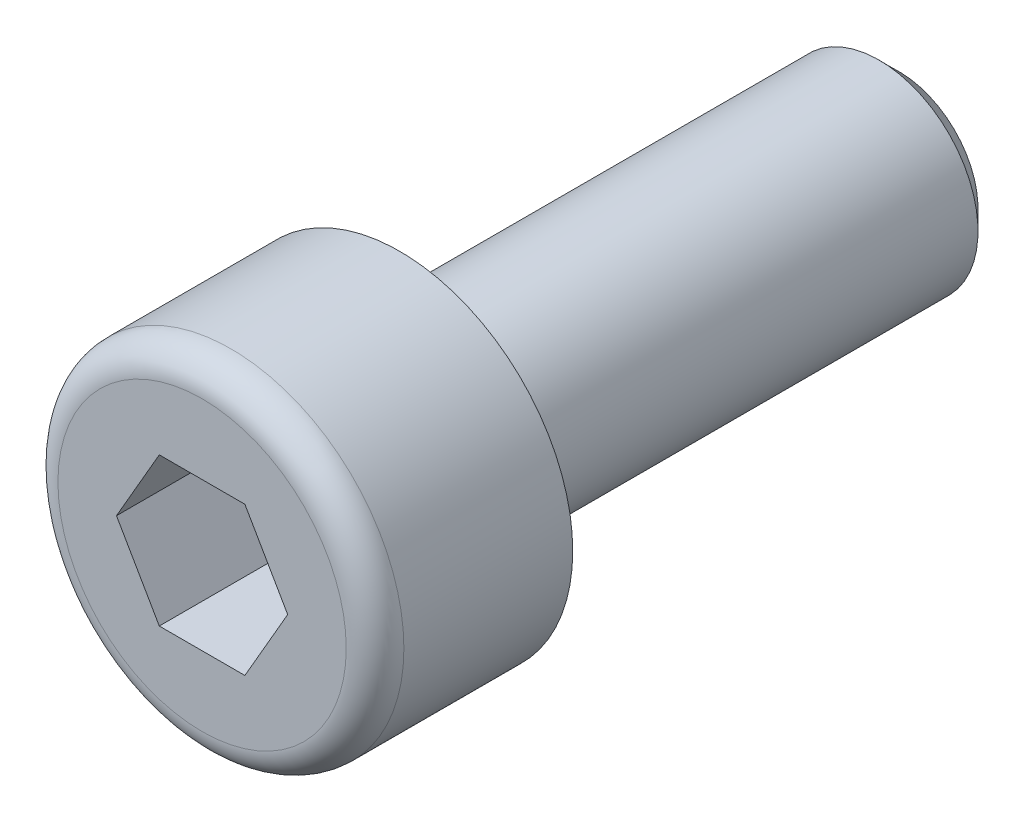
ISO-10303-21;
HEADER;
FILE_DESCRIPTION(('STEP AP214'),'2;1');
FILE_NAME('part.step','',(''),(''),'','','');
FILE_SCHEMA(('AUTOMOTIVE_DESIGN { 1 0 10303 214 1 1 1 1 }'));
ENDSEC;
DATA;
#1=APPLICATION_CONTEXT('core data for automotive mechanical design processes');
#2=APPLICATION_PROTOCOL_DEFINITION('international standard','automotive_design',2000,#1);
#3=PRODUCT_CONTEXT('',#1,'mechanical');
#4=PRODUCT('Part','Part','',(#3));
#5=PRODUCT_RELATED_PRODUCT_CATEGORY('part','',(#4));
#6=PRODUCT_DEFINITION_FORMATION('','',#4);
#7=PRODUCT_DEFINITION_CONTEXT('part definition',#1,'design');
#8=PRODUCT_DEFINITION('design','',#6,#7);
#9=PRODUCT_DEFINITION_SHAPE('','',#8);
#10=(LENGTH_UNIT() NAMED_UNIT(*) SI_UNIT(.MILLI.,.METRE.));
#11=(NAMED_UNIT(*) PLANE_ANGLE_UNIT() SI_UNIT($,.RADIAN.));
#12=(NAMED_UNIT(*) SI_UNIT($,.STERADIAN.) SOLID_ANGLE_UNIT());
#13=UNCERTAINTY_MEASURE_WITH_UNIT(LENGTH_MEASURE(1.E-05),#10,'distance_accuracy_value','');
#14=(GEOMETRIC_REPRESENTATION_CONTEXT(3) GLOBAL_UNCERTAINTY_ASSIGNED_CONTEXT((#13)) GLOBAL_UNIT_ASSIGNED_CONTEXT((#10,
#11,#12)) REPRESENTATION_CONTEXT('',''));
#15=CARTESIAN_POINT('',(0.,0.,0.));
#16=DIRECTION('',(0.,0.,1.));
#17=DIRECTION('',(1.,0.,0.));
#18=AXIS2_PLACEMENT_3D('',#15,#16,#17);
#19=CARTESIAN_POINT('',(0.,0.,4.));
#20=DIRECTION('',(0.,0.,-1.));
#21=DIRECTION('',(-1.,0.,0.));
#22=AXIS2_PLACEMENT_3D('',#19,#20,#21);
#23=CYLINDRICAL_SURFACE('',#22,3.5);
#24=CARTESIAN_POINT('',(0.,0.,3.41666666666667));
#25=DIRECTION('',(0.,0.,1.));
#26=DIRECTION('',(1.,0.,0.));
#27=AXIS2_PLACEMENT_3D('',#24,#25,#26);
#28=CIRCLE('',#27,3.5);
#29=CARTESIAN_POINT('',(3.5,0.,3.41666666666667));
#30=VERTEX_POINT('',#29);
#31=EDGE_CURVE('E11',#30,#30,#28,.F.);
#32=ORIENTED_EDGE('',*,*,#31,.T.);
#33=EDGE_LOOP('',(#32));
#34=FACE_BOUND('',#33,.T.);
#35=CARTESIAN_POINT('',(0.,0.,0.));
#36=DIRECTION('',(0.,0.,1.));
#37=DIRECTION('',(1.,0.,0.));
#38=AXIS2_PLACEMENT_3D('',#35,#36,#37);
#39=CIRCLE('',#38,3.5);
#40=CARTESIAN_POINT('',(3.5,0.,0.));
#41=VERTEX_POINT('',#40);
#42=EDGE_CURVE('E145',#41,#41,#39,.T.);
#43=ORIENTED_EDGE('',*,*,#42,.T.);
#44=EDGE_LOOP('',(#43));
#45=FACE_BOUND('',#44,.T.);
#46=ADVANCED_FACE('F37',(#34,#45),#23,.T.);
#47=CARTESIAN_POINT('',(0.,0.,4.));
#48=DIRECTION('',(0.,0.,1.));
#49=DIRECTION('',(1.,0.,0.));
#50=AXIS2_PLACEMENT_3D('',#47,#48,#49);
#51=PLANE('',#50);
#52=CARTESIAN_POINT('',(0.,0.,4.));
#53=DIRECTION('',(0.,0.,1.));
#54=DIRECTION('',(1.,0.,0.));
#55=AXIS2_PLACEMENT_3D('',#52,#53,#54);
#56=CIRCLE('',#55,2.91666666666667);
#57=CARTESIAN_POINT('',(2.91666666666667,0.,4.));
#58=VERTEX_POINT('',#57);
#59=EDGE_CURVE('E45',#58,#58,#56,.T.);
#60=ORIENTED_EDGE('',*,*,#59,.T.);
#61=EDGE_LOOP('',(#60));
#62=FACE_BOUND('',#61,.T.);
#63=DIRECTION('',(0.500000000000001,0.866025403784438,0.));
#64=VECTOR('',#63,1.);
#65=CARTESIAN_POINT('',(0.866025403784439,-1.5,4.));
#66=LINE('',#65,#64);
#67=CARTESIAN_POINT('',(0.866025403784439,-1.5,4.));
#68=VERTEX_POINT('',#67);
#69=CARTESIAN_POINT('',(1.73205080756888,0.,4.));
#70=VERTEX_POINT('',#69);
#71=EDGE_CURVE('E52',#68,#70,#66,.T.);
#72=ORIENTED_EDGE('',*,*,#71,.F.);
#73=DIRECTION('',(1.,0.,0.));
#74=VECTOR('',#73,1.);
#75=CARTESIAN_POINT('',(-0.866025403784439,-1.5,4.));
#76=LINE('',#75,#74);
#77=CARTESIAN_POINT('',(-0.866025403784439,-1.5,4.));
#78=VERTEX_POINT('',#77);
#79=EDGE_CURVE('E135',#78,#68,#76,.T.);
#80=ORIENTED_EDGE('',*,*,#79,.F.);
#81=DIRECTION('',(0.500000000000001,-0.866025403784438,0.));
#82=VECTOR('',#81,1.);
#83=CARTESIAN_POINT('',(-1.73205080756888,0.,4.));
#84=LINE('',#83,#82);
#85=CARTESIAN_POINT('',(-1.73205080756888,0.,4.));
#86=VERTEX_POINT('',#85);
#87=EDGE_CURVE('E133',#86,#78,#84,.T.);
#88=ORIENTED_EDGE('',*,*,#87,.F.);
#89=DIRECTION('',(-0.500000000000001,-0.866025403784438,0.));
#90=VECTOR('',#89,1.);
#91=CARTESIAN_POINT('',(-0.866025403784439,1.5,4.));
#92=LINE('',#91,#90);
#93=CARTESIAN_POINT('',(-0.866025403784439,1.5,4.));
#94=VERTEX_POINT('',#93);
#95=EDGE_CURVE('E100',#94,#86,#92,.T.);
#96=ORIENTED_EDGE('',*,*,#95,.F.);
#97=DIRECTION('',(-1.,0.,0.));
#98=VECTOR('',#97,1.);
#99=CARTESIAN_POINT('',(0.866025403784437,1.5,4.));
#100=LINE('',#99,#98);
#101=CARTESIAN_POINT('',(0.866025403784437,1.5,4.));
#102=VERTEX_POINT('',#101);
#103=EDGE_CURVE('E129',#102,#94,#100,.T.);
#104=ORIENTED_EDGE('',*,*,#103,.F.);
#105=DIRECTION('',(-0.500000000000002,0.866025403784438,0.));
#106=VECTOR('',#105,1.);
#107=CARTESIAN_POINT('',(1.73205080756888,0.,4.));
#108=LINE('',#107,#106);
#109=EDGE_CURVE('E126',#70,#102,#108,.T.);
#110=ORIENTED_EDGE('',*,*,#109,.F.);
#111=EDGE_LOOP('',(#72,#80,#88,#96,#104,#110));
#112=FACE_BOUND('',#111,.T.);
#113=ADVANCED_FACE('F174',(#62,#112),#51,.T.);
#114=CARTESIAN_POINT('',(0.,0.,0.));
#115=DIRECTION('',(0.,0.,1.));
#116=DIRECTION('',(1.,0.,0.));
#117=AXIS2_PLACEMENT_3D('',#114,#115,#116);
#118=PLANE('',#117);
#119=CARTESIAN_POINT('',(0.,0.,0.));
#120=DIRECTION('',(0.,0.,1.));
#121=DIRECTION('',(1.,0.,0.));
#122=AXIS2_PLACEMENT_3D('',#119,#120,#121);
#123=CIRCLE('',#122,2.);
#124=CARTESIAN_POINT('',(2.,0.,0.));
#125=VERTEX_POINT('',#124);
#126=EDGE_CURVE('E148',#125,#125,#123,.F.);
#127=ORIENTED_EDGE('',*,*,#126,.F.);
#128=EDGE_LOOP('',(#127));
#129=FACE_BOUND('',#128,.T.);
#130=ORIENTED_EDGE('',*,*,#42,.F.);
#131=EDGE_LOOP('',(#130));
#132=FACE_BOUND('',#131,.T.);
#133=ADVANCED_FACE('F172',(#129,#132),#118,.F.);
#134=CARTESIAN_POINT('',(0.,0.,-0.1));
#135=DIRECTION('',(0.,0.,1.));
#136=DIRECTION('',(1.,0.,0.));
#137=AXIS2_PLACEMENT_3D('',#134,#135,#136);
#138=CYLINDRICAL_SURFACE('',#137,2.);
#139=CARTESIAN_POINT('',(0.,0.,-0.0999999999999994));
#140=DIRECTION('',(0.,0.,-1.));
#141=DIRECTION('',(-1.,0.,0.));
#142=AXIS2_PLACEMENT_3D('',#139,#140,#141);
#143=CIRCLE('',#142,1.9998);
#144=CARTESIAN_POINT('',(-1.9998,0.,-0.0999999999999994));
#145=VERTEX_POINT('',#144);
#146=EDGE_CURVE('E139',#145,#145,#143,.T.);
#147=ORIENTED_EDGE('',*,*,#146,.F.);
#148=EDGE_LOOP('',(#147));
#149=FACE_BOUND('',#148,.T.);
#150=ORIENTED_EDGE('',*,*,#126,.T.);
#151=EDGE_LOOP('',(#150));
#152=FACE_BOUND('',#151,.T.);
#153=ADVANCED_FACE('F161',(#149,#152),#138,.T.);
#154=CARTESIAN_POINT('',(0.866025403784439,-1.5,0.));
#155=DIRECTION('',(0.866025403784438,-0.500000000000001,0.));
#156=DIRECTION('',(0.500000000000001,0.866025403784438,0.));
#157=AXIS2_PLACEMENT_3D('',#154,#155,#156);
#158=PLANE('',#157);
#159=ORIENTED_EDGE('',*,*,#71,.T.);
#160=DIRECTION('',(0.,0.,1.));
#161=VECTOR('',#160,1.);
#162=CARTESIAN_POINT('',(1.73205080756888,0.,0.));
#163=LINE('',#162,#161);
#164=CARTESIAN_POINT('',(1.73205080756888,0.,0.));
#165=VERTEX_POINT('',#164);
#166=EDGE_CURVE('E82',#165,#70,#163,.T.);
#167=ORIENTED_EDGE('',*,*,#166,.F.);
#168=DIRECTION('',(0.500000000000001,0.866025403784438,0.));
#169=VECTOR('',#168,1.);
#170=CARTESIAN_POINT('',(0.866025403784439,-1.5,0.));
#171=LINE('',#170,#169);
#172=CARTESIAN_POINT('',(0.866025403784439,-1.5,0.));
#173=VERTEX_POINT('',#172);
#174=EDGE_CURVE('E137',#173,#165,#171,.T.);
#175=ORIENTED_EDGE('',*,*,#174,.F.);
#176=DIRECTION('',(0.,0.,1.));
#177=VECTOR('',#176,1.);
#178=CARTESIAN_POINT('',(0.866025403784439,-1.5,0.));
#179=LINE('',#178,#177);
#180=EDGE_CURVE('E60',#173,#68,#179,.T.);
#181=ORIENTED_EDGE('',*,*,#180,.T.);
#182=EDGE_LOOP('',(#159,#167,#175,#181));
#183=FACE_BOUND('',#182,.T.);
#184=ADVANCED_FACE('F171',(#183),#158,.F.);
#185=CARTESIAN_POINT('',(-0.866025403784439,-1.5,0.));
#186=DIRECTION('',(0.,-1.,0.));
#187=DIRECTION('',(0.,0.,-1.));
#188=AXIS2_PLACEMENT_3D('',#185,#186,#187);
#189=PLANE('',#188);
#190=ORIENTED_EDGE('',*,*,#79,.T.);
#191=ORIENTED_EDGE('',*,*,#180,.F.);
#192=DIRECTION('',(1.,0.,0.));
#193=VECTOR('',#192,1.);
#194=CARTESIAN_POINT('',(-0.866025403784439,-1.5,0.));
#195=LINE('',#194,#193);
#196=CARTESIAN_POINT('',(-0.866025403784439,-1.5,0.));
#197=VERTEX_POINT('',#196);
#198=EDGE_CURVE('E112',#197,#173,#195,.T.);
#199=ORIENTED_EDGE('',*,*,#198,.F.);
#200=DIRECTION('',(0.,0.,1.));
#201=VECTOR('',#200,1.);
#202=CARTESIAN_POINT('',(-0.866025403784439,-1.5,0.));
#203=LINE('',#202,#201);
#204=EDGE_CURVE('E104',#197,#78,#203,.T.);
#205=ORIENTED_EDGE('',*,*,#204,.T.);
#206=EDGE_LOOP('',(#190,#191,#199,#205));
#207=FACE_BOUND('',#206,.T.);
#208=ADVANCED_FACE('F227',(#207),#189,.F.);
#209=CARTESIAN_POINT('',(-1.73205080756888,0.,0.));
#210=DIRECTION('',(-0.866025403784438,-0.500000000000001,0.));
#211=DIRECTION('',(0.500000000000001,-0.866025403784438,0.));
#212=AXIS2_PLACEMENT_3D('',#209,#210,#211);
#213=PLANE('',#212);
#214=ORIENTED_EDGE('',*,*,#87,.T.);
#215=ORIENTED_EDGE('',*,*,#204,.F.);
#216=DIRECTION('',(0.500000000000001,-0.866025403784438,0.));
#217=VECTOR('',#216,1.);
#218=CARTESIAN_POINT('',(-1.73205080756888,0.,0.));
#219=LINE('',#218,#217);
#220=CARTESIAN_POINT('',(-1.73205080756888,0.,0.));
#221=VERTEX_POINT('',#220);
#222=EDGE_CURVE('E108',#221,#197,#219,.T.);
#223=ORIENTED_EDGE('',*,*,#222,.F.);
#224=DIRECTION('',(0.,0.,1.));
#225=VECTOR('',#224,1.);
#226=CARTESIAN_POINT('',(-1.73205080756888,0.,0.));
#227=LINE('',#226,#225);
#228=EDGE_CURVE('E93',#221,#86,#227,.T.);
#229=ORIENTED_EDGE('',*,*,#228,.T.);
#230=EDGE_LOOP('',(#214,#215,#223,#229));
#231=FACE_BOUND('',#230,.T.);
#232=ADVANCED_FACE('F109',(#231),#213,.F.);
#233=CARTESIAN_POINT('',(-0.866025403784439,1.5,0.));
#234=DIRECTION('',(-0.866025403784438,0.500000000000001,0.));
#235=DIRECTION('',(-0.500000000000001,-0.866025403784438,0.));
#236=AXIS2_PLACEMENT_3D('',#233,#234,#235);
#237=PLANE('',#236);
#238=ORIENTED_EDGE('',*,*,#95,.T.);
#239=ORIENTED_EDGE('',*,*,#228,.F.);
#240=DIRECTION('',(-0.500000000000001,-0.866025403784438,0.));
#241=VECTOR('',#240,1.);
#242=CARTESIAN_POINT('',(-0.866025403784439,1.5,0.));
#243=LINE('',#242,#241);
#244=CARTESIAN_POINT('',(-0.866025403784439,1.5,0.));
#245=VERTEX_POINT('',#244);
#246=EDGE_CURVE('E97',#245,#221,#243,.T.);
#247=ORIENTED_EDGE('',*,*,#246,.F.);
#248=DIRECTION('',(0.,0.,1.));
#249=VECTOR('',#248,1.);
#250=CARTESIAN_POINT('',(-0.866025403784439,1.5,0.));
#251=LINE('',#250,#249);
#252=EDGE_CURVE('E105',#245,#94,#251,.T.);
#253=ORIENTED_EDGE('',*,*,#252,.T.);
#254=EDGE_LOOP('',(#238,#239,#247,#253));
#255=FACE_BOUND('',#254,.T.);
#256=ADVANCED_FACE('F95',(#255),#237,.F.);
#257=CARTESIAN_POINT('',(0.866025403784437,1.5,0.));
#258=DIRECTION('',(0.,1.,0.));
#259=DIRECTION('',(0.,0.,1.));
#260=AXIS2_PLACEMENT_3D('',#257,#258,#259);
#261=PLANE('',#260);
#262=ORIENTED_EDGE('',*,*,#103,.T.);
#263=ORIENTED_EDGE('',*,*,#252,.F.);
#264=DIRECTION('',(-1.,0.,0.));
#265=VECTOR('',#264,1.);
#266=CARTESIAN_POINT('',(0.866025403784437,1.5,0.));
#267=LINE('',#266,#265);
#268=CARTESIAN_POINT('',(0.866025403784437,1.5,0.));
#269=VERTEX_POINT('',#268);
#270=EDGE_CURVE('E118',#269,#245,#267,.T.);
#271=ORIENTED_EDGE('',*,*,#270,.F.);
#272=DIRECTION('',(0.,0.,1.));
#273=VECTOR('',#272,1.);
#274=CARTESIAN_POINT('',(0.866025403784437,1.5,0.));
#275=LINE('',#274,#273);
#276=EDGE_CURVE('E142',#269,#102,#275,.T.);
#277=ORIENTED_EDGE('',*,*,#276,.T.);
#278=EDGE_LOOP('',(#262,#263,#271,#277));
#279=FACE_BOUND('',#278,.T.);
#280=ADVANCED_FACE('F234',(#279),#261,.F.);
#281=CARTESIAN_POINT('',(1.73205080756888,0.,0.));
#282=DIRECTION('',(0.866025403784438,0.500000000000002,0.));
#283=DIRECTION('',(-0.500000000000002,0.866025403784438,0.));
#284=AXIS2_PLACEMENT_3D('',#281,#282,#283);
#285=PLANE('',#284);
#286=ORIENTED_EDGE('',*,*,#109,.T.);
#287=ORIENTED_EDGE('',*,*,#276,.F.);
#288=DIRECTION('',(-0.500000000000002,0.866025403784438,0.));
#289=VECTOR('',#288,1.);
#290=CARTESIAN_POINT('',(1.73205080756888,0.,0.));
#291=LINE('',#290,#289);
#292=EDGE_CURVE('E120',#165,#269,#291,.T.);
#293=ORIENTED_EDGE('',*,*,#292,.F.);
#294=ORIENTED_EDGE('',*,*,#166,.T.);
#295=EDGE_LOOP('',(#286,#287,#293,#294));
#296=FACE_BOUND('',#295,.T.);
#297=ADVANCED_FACE('F210',(#296),#285,.F.);
#298=CARTESIAN_POINT('',(1.73205080756888,0.,0.));
#299=DIRECTION('',(0.,0.,1.));
#300=DIRECTION('',(1.,0.,0.));
#301=AXIS2_PLACEMENT_3D('',#298,#299,#300);
#302=PLANE('',#301);
#303=ORIENTED_EDGE('',*,*,#174,.T.);
#304=ORIENTED_EDGE('',*,*,#292,.T.);
#305=ORIENTED_EDGE('',*,*,#270,.T.);
#306=ORIENTED_EDGE('',*,*,#246,.T.);
#307=ORIENTED_EDGE('',*,*,#222,.T.);
#308=ORIENTED_EDGE('',*,*,#198,.T.);
#309=EDGE_LOOP('',(#303,#304,#305,#306,#307,#308));
#310=FACE_BOUND('',#309,.T.);
#311=ADVANCED_FACE('F115',(#310),#302,.T.);
#312=CARTESIAN_POINT('',(0.,0.,-10.1));
#313=DIRECTION('',(0.,0.,1.));
#314=DIRECTION('',(1.,0.,0.));
#315=AXIS2_PLACEMENT_3D('',#312,#313,#314);
#316=CYLINDRICAL_SURFACE('',#315,1.9998);
#317=CARTESIAN_POINT('',(0.,0.,-9.70004));
#318=DIRECTION('',(0.,0.,-1.));
#319=DIRECTION('',(-1.,0.,0.));
#320=AXIS2_PLACEMENT_3D('',#317,#318,#319);
#321=CIRCLE('',#320,1.9998);
#322=CARTESIAN_POINT('',(-1.9998,0.,-9.70004));
#323=VERTEX_POINT('',#322);
#324=EDGE_CURVE('E198',#323,#323,#321,.F.);
#325=ORIENTED_EDGE('',*,*,#324,.T.);
#326=EDGE_LOOP('',(#325));
#327=FACE_BOUND('',#326,.T.);
#328=ORIENTED_EDGE('',*,*,#146,.T.);
#329=EDGE_LOOP('',(#328));
#330=FACE_BOUND('',#329,.T.);
#331=ADVANCED_FACE('F192',(#327,#330),#316,.T.);
#332=CARTESIAN_POINT('',(0.,0.,-10.1));
#333=DIRECTION('',(0.,0.,-1.));
#334=DIRECTION('',(-1.,0.,0.));
#335=AXIS2_PLACEMENT_3D('',#332,#333,#334);
#336=PLANE('',#335);
#337=CARTESIAN_POINT('',(0.,0.,-10.1));
#338=DIRECTION('',(0.,0.,-1.));
#339=DIRECTION('',(-1.,0.,0.));
#340=AXIS2_PLACEMENT_3D('',#337,#338,#339);
#341=CIRCLE('',#340,1.59983999999999);
#342=CARTESIAN_POINT('',(-1.59983999999999,0.,-10.1));
#343=VERTEX_POINT('',#342);
#344=EDGE_CURVE('E151',#343,#343,#341,.T.);
#345=ORIENTED_EDGE('',*,*,#344,.T.);
#346=EDGE_LOOP('',(#345));
#347=FACE_BOUND('',#346,.T.);
#348=ADVANCED_FACE('F185',(#347),#336,.T.);
#349=CARTESIAN_POINT('',(0.,0.,-10.1));
#350=DIRECTION('',(0.,0.,1.));
#351=DIRECTION('',(1.,0.,0.));
#352=AXIS2_PLACEMENT_3D('',#349,#350,#351);
#353=CONICAL_SURFACE('',#352,1.59983999999999,0.785398163397453);
#354=ORIENTED_EDGE('',*,*,#324,.F.);
#355=EDGE_LOOP('',(#354));
#356=FACE_BOUND('',#355,.T.);
#357=ORIENTED_EDGE('',*,*,#344,.F.);
#358=EDGE_LOOP('',(#357));
#359=FACE_BOUND('',#358,.T.);
#360=ADVANCED_FACE('F183',(#356,#359),#353,.T.);
#361=CARTESIAN_POINT('',(0.,0.,3.41666666666667));
#362=DIRECTION('',(0.,0.,1.));
#363=DIRECTION('',(1.,0.,0.));
#364=AXIS2_PLACEMENT_3D('',#361,#362,#363);
#365=TOROIDAL_SURFACE('',#364,2.91666666666667,0.583333333333333);
#366=ORIENTED_EDGE('',*,*,#31,.F.);
#367=EDGE_LOOP('',(#366));
#368=FACE_BOUND('',#367,.T.);
#369=ORIENTED_EDGE('',*,*,#59,.F.);
#370=EDGE_LOOP('',(#369));
#371=FACE_BOUND('',#370,.T.);
#372=ADVANCED_FACE('F39',(#368,#371),#365,.T.);
#373=CLOSED_SHELL('',(#46,#113,#133,#153,#184,#208,#232,#256,#280,#297,#311,#331,#348,#360,#372));
#374=MANIFOLD_SOLID_BREP('B2',#373);
#375=ADVANCED_BREP_SHAPE_REPRESENTATION('',(#18,#374),#14);
#376=SHAPE_DEFINITION_REPRESENTATION(#9,#375);
ENDSEC;
END-ISO-10303-21;
